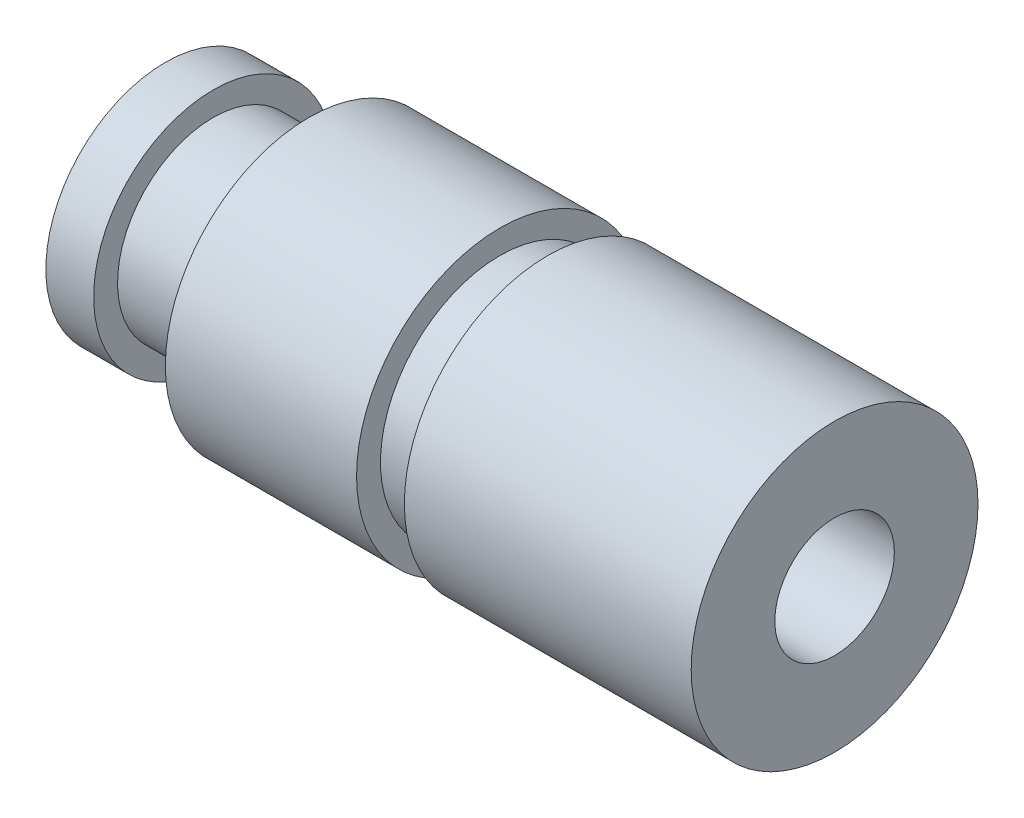
ISO-10303-21;
HEADER;
FILE_DESCRIPTION(('STEP AP214'),'2;1');
FILE_NAME('part.step','',(''),(''),'','','');
FILE_SCHEMA(('AUTOMOTIVE_DESIGN { 1 0 10303 214 1 1 1 1 }'));
ENDSEC;
DATA;
#1=APPLICATION_CONTEXT('core data for automotive mechanical design processes');
#2=APPLICATION_PROTOCOL_DEFINITION('international standard','automotive_design',2000,#1);
#3=PRODUCT_CONTEXT('',#1,'mechanical');
#4=PRODUCT('Part','Part','',(#3));
#5=PRODUCT_RELATED_PRODUCT_CATEGORY('part','',(#4));
#6=PRODUCT_DEFINITION_FORMATION('','',#4);
#7=PRODUCT_DEFINITION_CONTEXT('part definition',#1,'design');
#8=PRODUCT_DEFINITION('design','',#6,#7);
#9=PRODUCT_DEFINITION_SHAPE('','',#8);
#10=(LENGTH_UNIT() NAMED_UNIT(*) SI_UNIT(.MILLI.,.METRE.));
#11=(NAMED_UNIT(*) PLANE_ANGLE_UNIT() SI_UNIT($,.RADIAN.));
#12=(NAMED_UNIT(*) SI_UNIT($,.STERADIAN.) SOLID_ANGLE_UNIT());
#13=UNCERTAINTY_MEASURE_WITH_UNIT(LENGTH_MEASURE(1.E-05),#10,'distance_accuracy_value','');
#14=(GEOMETRIC_REPRESENTATION_CONTEXT(3) GLOBAL_UNCERTAINTY_ASSIGNED_CONTEXT((#13)) GLOBAL_UNIT_ASSIGNED_CONTEXT((#10,
#11,#12)) REPRESENTATION_CONTEXT('',''));
#15=CARTESIAN_POINT('',(0.,0.,0.));
#16=DIRECTION('',(0.,0.,1.));
#17=DIRECTION('',(1.,0.,0.));
#18=AXIS2_PLACEMENT_3D('',#15,#16,#17);
#19=CARTESIAN_POINT('',(0.,0.,0.));
#20=DIRECTION('',(-1.,0.,0.));
#21=DIRECTION('',(0.,-1.,0.));
#22=AXIS2_PLACEMENT_3D('',#19,#20,#21);
#23=PLANE('',#22);
#24=CARTESIAN_POINT('',(0.,0.,0.));
#25=DIRECTION('',(1.,0.,0.));
#26=DIRECTION('',(0.,1.,0.));
#27=AXIS2_PLACEMENT_3D('',#24,#25,#26);
#28=CIRCLE('',#27,2.5);
#29=CARTESIAN_POINT('',(0.,2.5,0.));
#30=VERTEX_POINT('',#29);
#31=EDGE_CURVE('E11',#30,#30,#28,.T.);
#32=ORIENTED_EDGE('',*,*,#31,.F.);
#33=EDGE_LOOP('',(#32));
#34=FACE_BOUND('',#33,.T.);
#35=ADVANCED_FACE('F38',(#34),#23,.T.);
#36=CARTESIAN_POINT('',(14.,0.,0.));
#37=DIRECTION('',(1.,0.,0.));
#38=DIRECTION('',(0.,1.,0.));
#39=AXIS2_PLACEMENT_3D('',#36,#37,#38);
#40=CYLINDRICAL_SURFACE('',#39,2.5);
#41=ORIENTED_EDGE('',*,*,#31,.T.);
#42=EDGE_LOOP('',(#41));
#43=FACE_BOUND('',#42,.T.);
#44=CARTESIAN_POINT('',(1.,0.,0.));
#45=DIRECTION('',(1.,0.,0.));
#46=DIRECTION('',(0.,1.,0.));
#47=AXIS2_PLACEMENT_3D('',#44,#45,#46);
#48=CIRCLE('',#47,2.5);
#49=CARTESIAN_POINT('',(1.,2.5,0.));
#50=VERTEX_POINT('',#49);
#51=EDGE_CURVE('E44',#50,#50,#48,.T.);
#52=ORIENTED_EDGE('',*,*,#51,.F.);
#53=EDGE_LOOP('',(#52));
#54=FACE_BOUND('',#53,.T.);
#55=ADVANCED_FACE('F85',(#43,#54),#40,.T.);
#56=CARTESIAN_POINT('',(1.,2.5,0.));
#57=DIRECTION('',(1.,0.,0.));
#58=DIRECTION('',(0.,1.,0.));
#59=AXIS2_PLACEMENT_3D('',#56,#57,#58);
#60=PLANE('',#59);
#61=ORIENTED_EDGE('',*,*,#51,.T.);
#62=EDGE_LOOP('',(#61));
#63=FACE_BOUND('',#62,.T.);
#64=CARTESIAN_POINT('',(1.,0.,0.));
#65=DIRECTION('',(1.,0.,0.));
#66=DIRECTION('',(0.,1.,0.));
#67=AXIS2_PLACEMENT_3D('',#64,#65,#66);
#68=CIRCLE('',#67,2.);
#69=CARTESIAN_POINT('',(1.,2.,0.));
#70=VERTEX_POINT('',#69);
#71=EDGE_CURVE('E77',#70,#70,#68,.T.);
#72=ORIENTED_EDGE('',*,*,#71,.F.);
#73=EDGE_LOOP('',(#72));
#74=FACE_BOUND('',#73,.T.);
#75=ADVANCED_FACE('F82',(#63,#74),#60,.T.);
#76=CARTESIAN_POINT('',(14.,0.,0.));
#77=DIRECTION('',(1.,0.,0.));
#78=DIRECTION('',(0.,1.,0.));
#79=AXIS2_PLACEMENT_3D('',#76,#77,#78);
#80=CYLINDRICAL_SURFACE('',#79,2.);
#81=ORIENTED_EDGE('',*,*,#71,.T.);
#82=EDGE_LOOP('',(#81));
#83=FACE_BOUND('',#82,.T.);
#84=CARTESIAN_POINT('',(3.,0.,0.));
#85=DIRECTION('',(1.,0.,0.));
#86=DIRECTION('',(0.,1.,0.));
#87=AXIS2_PLACEMENT_3D('',#84,#85,#86);
#88=CIRCLE('',#87,2.);
#89=CARTESIAN_POINT('',(3.,2.,0.));
#90=VERTEX_POINT('',#89);
#91=EDGE_CURVE('E74',#90,#90,#88,.T.);
#92=ORIENTED_EDGE('',*,*,#91,.F.);
#93=EDGE_LOOP('',(#92));
#94=FACE_BOUND('',#93,.T.);
#95=ADVANCED_FACE('F92',(#83,#94),#80,.T.);
#96=CARTESIAN_POINT('',(3.,2.,0.));
#97=DIRECTION('',(-1.,0.,0.));
#98=DIRECTION('',(0.,-1.,0.));
#99=AXIS2_PLACEMENT_3D('',#96,#97,#98);
#100=PLANE('',#99);
#101=ORIENTED_EDGE('',*,*,#91,.T.);
#102=EDGE_LOOP('',(#101));
#103=FACE_BOUND('',#102,.T.);
#104=CARTESIAN_POINT('',(3.,0.,0.));
#105=DIRECTION('',(1.,0.,0.));
#106=DIRECTION('',(0.,1.,0.));
#107=AXIS2_PLACEMENT_3D('',#104,#105,#106);
#108=CIRCLE('',#107,3.);
#109=CARTESIAN_POINT('',(3.,3.,0.));
#110=VERTEX_POINT('',#109);
#111=EDGE_CURVE('E71',#110,#110,#108,.T.);
#112=ORIENTED_EDGE('',*,*,#111,.F.);
#113=EDGE_LOOP('',(#112));
#114=FACE_BOUND('',#113,.T.);
#115=ADVANCED_FACE('F98',(#103,#114),#100,.T.);
#116=CARTESIAN_POINT('',(14.,0.,0.));
#117=DIRECTION('',(1.,0.,0.));
#118=DIRECTION('',(0.,1.,0.));
#119=AXIS2_PLACEMENT_3D('',#116,#117,#118);
#120=CYLINDRICAL_SURFACE('',#119,3.);
#121=CARTESIAN_POINT('',(7.,0.,0.));
#122=DIRECTION('',(-1.,0.,0.));
#123=DIRECTION('',(0.,-1.,0.));
#124=AXIS2_PLACEMENT_3D('',#121,#122,#123);
#125=CIRCLE('',#124,3.);
#126=CARTESIAN_POINT('',(7.,-3.,0.));
#127=VERTEX_POINT('',#126);
#128=EDGE_CURVE('E64',#127,#127,#125,.T.);
#129=ORIENTED_EDGE('',*,*,#128,.T.);
#130=EDGE_LOOP('',(#129));
#131=FACE_BOUND('',#130,.T.);
#132=ORIENTED_EDGE('',*,*,#111,.T.);
#133=EDGE_LOOP('',(#132));
#134=FACE_BOUND('',#133,.T.);
#135=ADVANCED_FACE('F102',(#131,#134),#120,.T.);
#136=CARTESIAN_POINT('',(8.,0.,0.));
#137=DIRECTION('',(-1.,0.,0.));
#138=DIRECTION('',(0.,-1.,0.));
#139=AXIS2_PLACEMENT_3D('',#136,#137,#138);
#140=PLANE('',#139);
#141=CARTESIAN_POINT('',(8.,0.,0.));
#142=DIRECTION('',(-1.,0.,0.));
#143=DIRECTION('',(0.,-1.,0.));
#144=AXIS2_PLACEMENT_3D('',#141,#142,#143);
#145=CIRCLE('',#144,2.5);
#146=CARTESIAN_POINT('',(8.,-2.5,0.));
#147=VERTEX_POINT('',#146);
#148=EDGE_CURVE('E129',#147,#147,#145,.T.);
#149=ORIENTED_EDGE('',*,*,#148,.F.);
#150=EDGE_LOOP('',(#149));
#151=FACE_BOUND('',#150,.T.);
#152=CARTESIAN_POINT('',(8.,0.,0.));
#153=DIRECTION('',(-1.,0.,0.));
#154=DIRECTION('',(0.,-1.,0.));
#155=AXIS2_PLACEMENT_3D('',#152,#153,#154);
#156=CIRCLE('',#155,3.);
#157=CARTESIAN_POINT('',(8.,-3.,0.));
#158=VERTEX_POINT('',#157);
#159=EDGE_CURVE('E58',#158,#158,#156,.T.);
#160=ORIENTED_EDGE('',*,*,#159,.T.);
#161=EDGE_LOOP('',(#160));
#162=FACE_BOUND('',#161,.T.);
#163=ADVANCED_FACE('F106',(#151,#162),#140,.T.);
#164=CARTESIAN_POINT('',(7.,0.,0.));
#165=DIRECTION('',(-1.,0.,0.));
#166=DIRECTION('',(0.,-1.,0.));
#167=AXIS2_PLACEMENT_3D('',#164,#165,#166);
#168=PLANE('',#167);
#169=CARTESIAN_POINT('',(7.,0.,0.));
#170=DIRECTION('',(-1.,0.,0.));
#171=DIRECTION('',(0.,-1.,0.));
#172=AXIS2_PLACEMENT_3D('',#169,#170,#171);
#173=CIRCLE('',#172,2.5);
#174=CARTESIAN_POINT('',(7.,-2.5,0.));
#175=VERTEX_POINT('',#174);
#176=EDGE_CURVE('E132',#175,#175,#173,.T.);
#177=ORIENTED_EDGE('',*,*,#176,.T.);
#178=EDGE_LOOP('',(#177));
#179=FACE_BOUND('',#178,.T.);
#180=ORIENTED_EDGE('',*,*,#128,.F.);
#181=EDGE_LOOP('',(#180));
#182=FACE_BOUND('',#181,.T.);
#183=ADVANCED_FACE('F115',(#179,#182),#168,.F.);
#184=CARTESIAN_POINT('',(8.,0.,0.));
#185=DIRECTION('',(-1.,0.,0.));
#186=DIRECTION('',(0.,-1.,0.));
#187=AXIS2_PLACEMENT_3D('',#184,#185,#186);
#188=CYLINDRICAL_SURFACE('',#187,2.5);
#189=ORIENTED_EDGE('',*,*,#148,.T.);
#190=EDGE_LOOP('',(#189));
#191=FACE_BOUND('',#190,.T.);
#192=ORIENTED_EDGE('',*,*,#176,.F.);
#193=EDGE_LOOP('',(#192));
#194=FACE_BOUND('',#193,.T.);
#195=ADVANCED_FACE('F51',(#191,#194),#188,.T.);
#196=CARTESIAN_POINT('',(5.5,0.,0.));
#197=DIRECTION('',(1.,0.,0.));
#198=DIRECTION('',(0.,0.,-1.));
#199=AXIS2_PLACEMENT_3D('',#196,#197,#198);
#200=CONICAL_SURFACE('',#199,1.25,1.02974425867665);
#201=CARTESIAN_POINT('',(4.74892422621555,0.,0.));
#202=VERTEX_POINT('',#201);
#203=VERTEX_LOOP('',#202);
#204=FACE_BOUND('',#203,.T.);
#205=CARTESIAN_POINT('',(5.5,0.,0.));
#206=DIRECTION('',(1.,0.,0.));
#207=DIRECTION('',(0.,0.,-1.));
#208=AXIS2_PLACEMENT_3D('',#205,#206,#207);
#209=CIRCLE('',#208,1.25);
#210=CARTESIAN_POINT('',(5.5,0.,-1.25));
#211=VERTEX_POINT('',#210);
#212=EDGE_CURVE('E55',#211,#211,#209,.T.);
#213=ORIENTED_EDGE('',*,*,#212,.T.);
#214=EDGE_LOOP('',(#213));
#215=FACE_BOUND('',#214,.T.);
#216=ADVANCED_FACE('F47',(#204,#215),#200,.F.);
#217=CARTESIAN_POINT('',(14.,0.,0.));
#218=DIRECTION('',(1.,0.,0.));
#219=DIRECTION('',(0.,0.,-1.));
#220=AXIS2_PLACEMENT_3D('',#217,#218,#219);
#221=CYLINDRICAL_SURFACE('',#220,1.24999999999999);
#222=ORIENTED_EDGE('',*,*,#212,.F.);
#223=EDGE_LOOP('',(#222));
#224=FACE_BOUND('',#223,.T.);
#225=CARTESIAN_POINT('',(14.,0.,0.));
#226=DIRECTION('',(1.,0.,0.));
#227=DIRECTION('',(0.,0.,-1.));
#228=AXIS2_PLACEMENT_3D('',#225,#226,#227);
#229=CIRCLE('',#228,1.24999999999999);
#230=CARTESIAN_POINT('',(14.,0.,-1.24999999999999));
#231=VERTEX_POINT('',#230);
#232=EDGE_CURVE('E57',#231,#231,#229,.T.);
#233=ORIENTED_EDGE('',*,*,#232,.T.);
#234=EDGE_LOOP('',(#233));
#235=FACE_BOUND('',#234,.T.);
#236=ADVANCED_FACE('F50',(#224,#235),#221,.F.);
#237=CARTESIAN_POINT('',(14.,3.,0.));
#238=DIRECTION('',(1.,0.,0.));
#239=DIRECTION('',(0.,1.,0.));
#240=AXIS2_PLACEMENT_3D('',#237,#238,#239);
#241=PLANE('',#240);
#242=ORIENTED_EDGE('',*,*,#232,.F.);
#243=EDGE_LOOP('',(#242));
#244=FACE_BOUND('',#243,.T.);
#245=CARTESIAN_POINT('',(14.,0.,0.));
#246=DIRECTION('',(1.,0.,0.));
#247=DIRECTION('',(0.,1.,0.));
#248=AXIS2_PLACEMENT_3D('',#245,#246,#247);
#249=CIRCLE('',#248,3.);
#250=CARTESIAN_POINT('',(14.,3.,0.));
#251=VERTEX_POINT('',#250);
#252=EDGE_CURVE('E61',#251,#251,#249,.T.);
#253=ORIENTED_EDGE('',*,*,#252,.T.);
#254=EDGE_LOOP('',(#253));
#255=FACE_BOUND('',#254,.T.);
#256=ADVANCED_FACE('F109',(#244,#255),#241,.T.);
#257=ORIENTED_EDGE('',*,*,#252,.F.);
#258=EDGE_LOOP('',(#257));
#259=FACE_BOUND('',#258,.T.);
#260=ORIENTED_EDGE('',*,*,#159,.F.);
#261=EDGE_LOOP('',(#260));
#262=FACE_BOUND('',#261,.T.);
#263=ADVANCED_FACE('F108',(#259,#262),#120,.T.);
#264=CLOSED_SHELL('',(#35,#55,#75,#95,#115,#135,#163,#183,#195,#216,#236,#256,#263));
#265=MANIFOLD_SOLID_BREP('B2',#264);
#266=ADVANCED_BREP_SHAPE_REPRESENTATION('',(#18,#265),#14);
#267=SHAPE_DEFINITION_REPRESENTATION(#9,#266);
ENDSEC;
END-ISO-10303-21;
